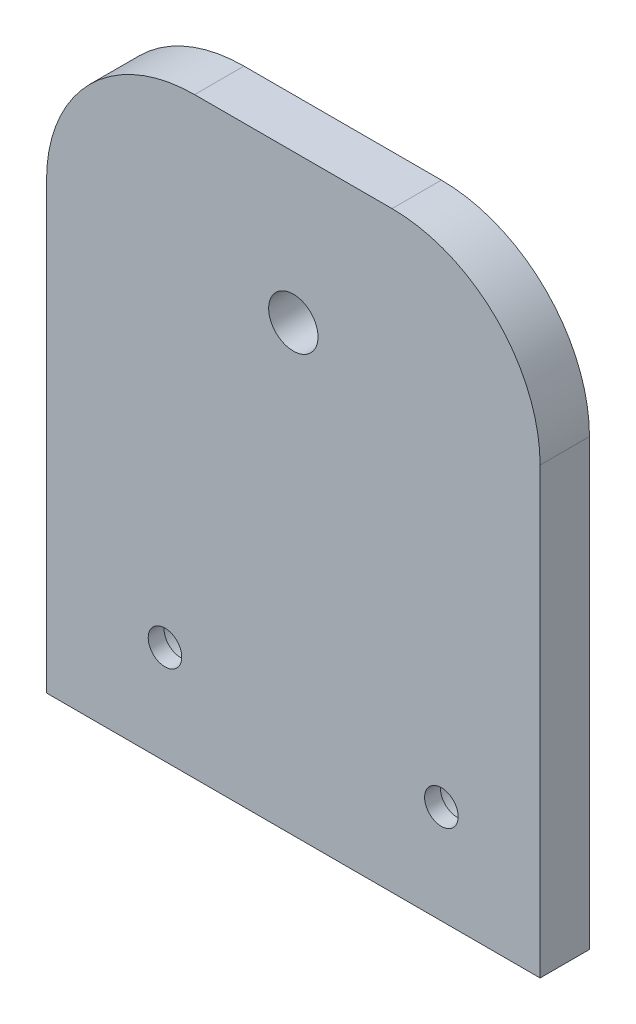
ISO-10303-21;
HEADER;
FILE_DESCRIPTION(('STEP AP214'),'2;1');
FILE_NAME('part.step','',(''),(''),'','','');
FILE_SCHEMA(('AUTOMOTIVE_DESIGN { 1 0 10303 214 1 1 1 1 }'));
ENDSEC;
DATA;
#1=APPLICATION_CONTEXT('core data for automotive mechanical design processes');
#2=APPLICATION_PROTOCOL_DEFINITION('international standard','automotive_design',2000,#1);
#3=PRODUCT_CONTEXT('',#1,'mechanical');
#4=PRODUCT('Part','Part','',(#3));
#5=PRODUCT_RELATED_PRODUCT_CATEGORY('part','',(#4));
#6=PRODUCT_DEFINITION_FORMATION('','',#4);
#7=PRODUCT_DEFINITION_CONTEXT('part definition',#1,'design');
#8=PRODUCT_DEFINITION('design','',#6,#7);
#9=PRODUCT_DEFINITION_SHAPE('','',#8);
#10=(LENGTH_UNIT() NAMED_UNIT(*) SI_UNIT(.MILLI.,.METRE.));
#11=(NAMED_UNIT(*) PLANE_ANGLE_UNIT() SI_UNIT($,.RADIAN.));
#12=(NAMED_UNIT(*) SI_UNIT($,.STERADIAN.) SOLID_ANGLE_UNIT());
#13=UNCERTAINTY_MEASURE_WITH_UNIT(LENGTH_MEASURE(1.E-05),#10,'distance_accuracy_value','');
#14=(GEOMETRIC_REPRESENTATION_CONTEXT(3) GLOBAL_UNCERTAINTY_ASSIGNED_CONTEXT((#13)) GLOBAL_UNIT_ASSIGNED_CONTEXT((#10,
#11,#12)) REPRESENTATION_CONTEXT('',''));
#15=CARTESIAN_POINT('',(0.,0.,0.));
#16=DIRECTION('',(0.,0.,1.));
#17=DIRECTION('',(1.,0.,0.));
#18=AXIS2_PLACEMENT_3D('',#15,#16,#17);
#19=CARTESIAN_POINT('',(15.,45.,5.));
#20=DIRECTION('',(0.,0.,-1.));
#21=DIRECTION('',(-1.,0.,0.));
#22=AXIS2_PLACEMENT_3D('',#19,#20,#21);
#23=PLANE('',#22);
#24=CARTESIAN_POINT('',(40.,10.,5.));
#25=DIRECTION('',(0.,0.,-1.));
#26=DIRECTION('',(-1.,0.,0.));
#27=AXIS2_PLACEMENT_3D('',#24,#25,#26);
#28=CIRCLE('',#27,1.7);
#29=CARTESIAN_POINT('',(38.3,10.,5.));
#30=VERTEX_POINT('',#29);
#31=EDGE_CURVE('E230',#30,#30,#28,.T.);
#32=ORIENTED_EDGE('',*,*,#31,.T.);
#33=EDGE_LOOP('',(#32));
#34=FACE_BOUND('',#33,.T.);
#35=CARTESIAN_POINT('',(12.,10.,5.));
#36=DIRECTION('',(0.,0.,-1.));
#37=DIRECTION('',(-1.,0.,0.));
#38=AXIS2_PLACEMENT_3D('',#35,#36,#37);
#39=CIRCLE('',#38,1.7);
#40=CARTESIAN_POINT('',(10.3,10.,5.));
#41=VERTEX_POINT('',#40);
#42=EDGE_CURVE('E245',#41,#41,#39,.T.);
#43=ORIENTED_EDGE('',*,*,#42,.T.);
#44=EDGE_LOOP('',(#43));
#45=FACE_BOUND('',#44,.T.);
#46=DIRECTION('',(0.,-1.,0.));
#47=VECTOR('',#46,1.);
#48=CARTESIAN_POINT('',(0.,0.,5.));
#49=LINE('',#48,#47);
#50=CARTESIAN_POINT('',(0.,44.9999999999999,5.));
#51=VERTEX_POINT('',#50);
#52=CARTESIAN_POINT('',(0.,0.,5.));
#53=VERTEX_POINT('',#52);
#54=EDGE_CURVE('E149',#51,#53,#49,.T.);
#55=ORIENTED_EDGE('',*,*,#54,.T.);
#56=DIRECTION('',(1.,0.,0.));
#57=VECTOR('',#56,1.);
#58=CARTESIAN_POINT('',(0.,0.,5.));
#59=LINE('',#58,#57);
#60=CARTESIAN_POINT('',(50.,0.,5.));
#61=VERTEX_POINT('',#60);
#62=EDGE_CURVE('E97',#53,#61,#59,.T.);
#63=ORIENTED_EDGE('',*,*,#62,.T.);
#64=DIRECTION('',(0.,1.,0.));
#65=VECTOR('',#64,1.);
#66=CARTESIAN_POINT('',(50.,0.,5.));
#67=LINE('',#66,#65);
#68=CARTESIAN_POINT('',(50.,44.9999999999999,5.));
#69=VERTEX_POINT('',#68);
#70=EDGE_CURVE('E110',#61,#69,#67,.T.);
#71=ORIENTED_EDGE('',*,*,#70,.T.);
#72=CARTESIAN_POINT('',(35.,45.,5.));
#73=DIRECTION('',(0.,0.,1.));
#74=DIRECTION('',(-1.,0.,0.));
#75=AXIS2_PLACEMENT_3D('',#72,#73,#74);
#76=CIRCLE('',#75,15.);
#77=CARTESIAN_POINT('',(34.9999999999999,60.,5.));
#78=VERTEX_POINT('',#77);
#79=EDGE_CURVE('E104',#69,#78,#76,.T.);
#80=ORIENTED_EDGE('',*,*,#79,.T.);
#81=DIRECTION('',(-1.,0.,0.));
#82=VECTOR('',#81,1.);
#83=CARTESIAN_POINT('',(15.0000000000001,60.,5.));
#84=LINE('',#83,#82);
#85=CARTESIAN_POINT('',(15.0000000000001,60.,5.));
#86=VERTEX_POINT('',#85);
#87=EDGE_CURVE('E108',#78,#86,#84,.T.);
#88=ORIENTED_EDGE('',*,*,#87,.T.);
#89=CARTESIAN_POINT('',(15.,45.,5.));
#90=DIRECTION('',(0.,0.,1.));
#91=DIRECTION('',(-1.,0.,0.));
#92=AXIS2_PLACEMENT_3D('',#89,#90,#91);
#93=CIRCLE('',#92,15.);
#94=EDGE_CURVE('E60',#86,#51,#93,.T.);
#95=ORIENTED_EDGE('',*,*,#94,.T.);
#96=EDGE_LOOP('',(#55,#63,#71,#80,#88,#95));
#97=FACE_BOUND('',#96,.T.);
#98=CARTESIAN_POINT('',(25.,45.,5.));
#99=DIRECTION('',(0.,0.,1.));
#100=DIRECTION('',(1.,0.,0.));
#101=AXIS2_PLACEMENT_3D('',#98,#99,#100);
#102=CIRCLE('',#101,2.5);
#103=CARTESIAN_POINT('',(27.5,45.,5.));
#104=VERTEX_POINT('',#103);
#105=EDGE_CURVE('E137',#104,#104,#102,.T.);
#106=ORIENTED_EDGE('',*,*,#105,.F.);
#107=EDGE_LOOP('',(#106));
#108=FACE_BOUND('',#107,.T.);
#109=ADVANCED_FACE('F42',(#34,#45,#97,#108),#23,.F.);
#110=CARTESIAN_POINT('',(15.,45.,0.));
#111=DIRECTION('',(0.,0.,-1.));
#112=DIRECTION('',(-1.,0.,0.));
#113=AXIS2_PLACEMENT_3D('',#110,#111,#112);
#114=PLANE('',#113);
#115=CARTESIAN_POINT('',(40.,10.,0.));
#116=DIRECTION('',(0.,0.,-1.));
#117=DIRECTION('',(-1.,0.,0.));
#118=AXIS2_PLACEMENT_3D('',#115,#116,#117);
#119=CIRCLE('',#118,3.25);
#120=CARTESIAN_POINT('',(36.75,10.,0.));
#121=VERTEX_POINT('',#120);
#122=EDGE_CURVE('E220',#121,#121,#119,.T.);
#123=ORIENTED_EDGE('',*,*,#122,.F.);
#124=EDGE_LOOP('',(#123));
#125=FACE_BOUND('',#124,.T.);
#126=CARTESIAN_POINT('',(12.,10.,0.));
#127=DIRECTION('',(0.,0.,-1.));
#128=DIRECTION('',(-1.,0.,0.));
#129=AXIS2_PLACEMENT_3D('',#126,#127,#128);
#130=CIRCLE('',#129,3.25);
#131=CARTESIAN_POINT('',(8.75,10.,0.));
#132=VERTEX_POINT('',#131);
#133=EDGE_CURVE('E233',#132,#132,#130,.T.);
#134=ORIENTED_EDGE('',*,*,#133,.F.);
#135=EDGE_LOOP('',(#134));
#136=FACE_BOUND('',#135,.T.);
#137=DIRECTION('',(0.,-1.,0.));
#138=VECTOR('',#137,1.);
#139=CARTESIAN_POINT('',(0.,0.,0.));
#140=LINE('',#139,#138);
#141=CARTESIAN_POINT('',(0.,44.9999999999999,0.));
#142=VERTEX_POINT('',#141);
#143=CARTESIAN_POINT('',(0.,0.,0.));
#144=VERTEX_POINT('',#143);
#145=EDGE_CURVE('E132',#142,#144,#140,.T.);
#146=ORIENTED_EDGE('',*,*,#145,.F.);
#147=CARTESIAN_POINT('',(15.,45.,0.));
#148=DIRECTION('',(0.,0.,1.));
#149=DIRECTION('',(-1.,0.,0.));
#150=AXIS2_PLACEMENT_3D('',#147,#148,#149);
#151=CIRCLE('',#150,15.);
#152=CARTESIAN_POINT('',(15.0000000000001,60.,0.));
#153=VERTEX_POINT('',#152);
#154=EDGE_CURVE('E89',#153,#142,#151,.T.);
#155=ORIENTED_EDGE('',*,*,#154,.F.);
#156=DIRECTION('',(-1.,0.,0.));
#157=VECTOR('',#156,1.);
#158=CARTESIAN_POINT('',(15.0000000000001,60.,0.));
#159=LINE('',#158,#157);
#160=CARTESIAN_POINT('',(34.9999999999999,60.,0.));
#161=VERTEX_POINT('',#160);
#162=EDGE_CURVE('E83',#161,#153,#159,.T.);
#163=ORIENTED_EDGE('',*,*,#162,.F.);
#164=CARTESIAN_POINT('',(35.,45.,0.));
#165=DIRECTION('',(0.,0.,1.));
#166=DIRECTION('',(-1.,0.,0.));
#167=AXIS2_PLACEMENT_3D('',#164,#165,#166);
#168=CIRCLE('',#167,15.);
#169=CARTESIAN_POINT('',(50.,44.9999999999999,0.));
#170=VERTEX_POINT('',#169);
#171=EDGE_CURVE('E119',#170,#161,#168,.T.);
#172=ORIENTED_EDGE('',*,*,#171,.F.);
#173=DIRECTION('',(0.,1.,0.));
#174=VECTOR('',#173,1.);
#175=CARTESIAN_POINT('',(50.,0.,0.));
#176=LINE('',#175,#174);
#177=CARTESIAN_POINT('',(50.,0.,0.));
#178=VERTEX_POINT('',#177);
#179=EDGE_CURVE('E140',#178,#170,#176,.T.);
#180=ORIENTED_EDGE('',*,*,#179,.F.);
#181=DIRECTION('',(1.,0.,0.));
#182=VECTOR('',#181,1.);
#183=CARTESIAN_POINT('',(0.,0.,0.));
#184=LINE('',#183,#182);
#185=EDGE_CURVE('E136',#144,#178,#184,.T.);
#186=ORIENTED_EDGE('',*,*,#185,.F.);
#187=EDGE_LOOP('',(#146,#155,#163,#172,#180,#186));
#188=FACE_BOUND('',#187,.T.);
#189=CARTESIAN_POINT('',(25.,45.,0.));
#190=DIRECTION('',(0.,0.,1.));
#191=DIRECTION('',(1.,0.,0.));
#192=AXIS2_PLACEMENT_3D('',#189,#190,#191);
#193=CIRCLE('',#192,2.5);
#194=CARTESIAN_POINT('',(27.5,45.,0.));
#195=VERTEX_POINT('',#194);
#196=EDGE_CURVE('E249',#195,#195,#193,.T.);
#197=ORIENTED_EDGE('',*,*,#196,.T.);
#198=EDGE_LOOP('',(#197));
#199=FACE_BOUND('',#198,.T.);
#200=ADVANCED_FACE('F162',(#125,#136,#188,#199),#114,.T.);
#201=CARTESIAN_POINT('',(0.,0.,5.));
#202=DIRECTION('',(1.,0.,0.));
#203=DIRECTION('',(0.,0.,-1.));
#204=AXIS2_PLACEMENT_3D('',#201,#202,#203);
#205=PLANE('',#204);
#206=ORIENTED_EDGE('',*,*,#145,.T.);
#207=DIRECTION('',(0.,0.,-1.));
#208=VECTOR('',#207,1.);
#209=CARTESIAN_POINT('',(0.,0.,5.));
#210=LINE('',#209,#208);
#211=EDGE_CURVE('E11',#53,#144,#210,.T.);
#212=ORIENTED_EDGE('',*,*,#211,.F.);
#213=ORIENTED_EDGE('',*,*,#54,.F.);
#214=DIRECTION('',(0.,0.,-1.));
#215=VECTOR('',#214,1.);
#216=CARTESIAN_POINT('',(0.,44.9999999999999,5.));
#217=LINE('',#216,#215);
#218=EDGE_CURVE('E128',#51,#142,#217,.T.);
#219=ORIENTED_EDGE('',*,*,#218,.T.);
#220=EDGE_LOOP('',(#206,#212,#213,#219));
#221=FACE_BOUND('',#220,.T.);
#222=ADVANCED_FACE('F44',(#221),#205,.F.);
#223=CARTESIAN_POINT('',(0.,0.,5.));
#224=DIRECTION('',(0.,1.,0.));
#225=DIRECTION('',(0.,0.,1.));
#226=AXIS2_PLACEMENT_3D('',#223,#224,#225);
#227=PLANE('',#226);
#228=ORIENTED_EDGE('',*,*,#185,.T.);
#229=DIRECTION('',(0.,0.,-1.));
#230=VECTOR('',#229,1.);
#231=CARTESIAN_POINT('',(50.,0.,5.));
#232=LINE('',#231,#230);
#233=EDGE_CURVE('E52',#61,#178,#232,.T.);
#234=ORIENTED_EDGE('',*,*,#233,.F.);
#235=ORIENTED_EDGE('',*,*,#62,.F.);
#236=ORIENTED_EDGE('',*,*,#211,.T.);
#237=EDGE_LOOP('',(#228,#234,#235,#236));
#238=FACE_BOUND('',#237,.T.);
#239=ADVANCED_FACE('F324',(#238),#227,.F.);
#240=CARTESIAN_POINT('',(50.,0.,5.));
#241=DIRECTION('',(-1.,0.,0.));
#242=DIRECTION('',(0.,-1.,0.));
#243=AXIS2_PLACEMENT_3D('',#240,#241,#242);
#244=PLANE('',#243);
#245=ORIENTED_EDGE('',*,*,#179,.T.);
#246=DIRECTION('',(0.,0.,-1.));
#247=VECTOR('',#246,1.);
#248=CARTESIAN_POINT('',(50.,44.9999999999999,5.));
#249=LINE('',#248,#247);
#250=EDGE_CURVE('E121',#69,#170,#249,.T.);
#251=ORIENTED_EDGE('',*,*,#250,.F.);
#252=ORIENTED_EDGE('',*,*,#70,.F.);
#253=ORIENTED_EDGE('',*,*,#233,.T.);
#254=EDGE_LOOP('',(#245,#251,#252,#253));
#255=FACE_BOUND('',#254,.T.);
#256=ADVANCED_FACE('F159',(#255),#244,.F.);
#257=CARTESIAN_POINT('',(35.,45.,5.));
#258=DIRECTION('',(0.,0.,-1.));
#259=DIRECTION('',(-1.,0.,0.));
#260=AXIS2_PLACEMENT_3D('',#257,#258,#259);
#261=CYLINDRICAL_SURFACE('',#260,15.);
#262=ORIENTED_EDGE('',*,*,#171,.T.);
#263=DIRECTION('',(0.,0.,-1.));
#264=VECTOR('',#263,1.);
#265=CARTESIAN_POINT('',(34.9999999999999,60.,5.));
#266=LINE('',#265,#264);
#267=EDGE_CURVE('E116',#78,#161,#266,.T.);
#268=ORIENTED_EDGE('',*,*,#267,.F.);
#269=ORIENTED_EDGE('',*,*,#79,.F.);
#270=ORIENTED_EDGE('',*,*,#250,.T.);
#271=EDGE_LOOP('',(#262,#268,#269,#270));
#272=FACE_BOUND('',#271,.T.);
#273=ADVANCED_FACE('F117',(#272),#261,.T.);
#274=CARTESIAN_POINT('',(15.0000000000001,60.,5.));
#275=DIRECTION('',(0.,-1.,0.));
#276=DIRECTION('',(0.,0.,-1.));
#277=AXIS2_PLACEMENT_3D('',#274,#275,#276);
#278=PLANE('',#277);
#279=ORIENTED_EDGE('',*,*,#162,.T.);
#280=DIRECTION('',(0.,0.,-1.));
#281=VECTOR('',#280,1.);
#282=CARTESIAN_POINT('',(15.0000000000001,60.,5.));
#283=LINE('',#282,#281);
#284=EDGE_CURVE('E122',#86,#153,#283,.T.);
#285=ORIENTED_EDGE('',*,*,#284,.F.);
#286=ORIENTED_EDGE('',*,*,#87,.F.);
#287=ORIENTED_EDGE('',*,*,#267,.T.);
#288=EDGE_LOOP('',(#279,#285,#286,#287));
#289=FACE_BOUND('',#288,.T.);
#290=ADVANCED_FACE('F124',(#289),#278,.F.);
#291=CARTESIAN_POINT('',(15.,45.,5.));
#292=DIRECTION('',(0.,0.,-1.));
#293=DIRECTION('',(-1.,0.,0.));
#294=AXIS2_PLACEMENT_3D('',#291,#292,#293);
#295=CYLINDRICAL_SURFACE('',#294,15.);
#296=ORIENTED_EDGE('',*,*,#154,.T.);
#297=ORIENTED_EDGE('',*,*,#218,.F.);
#298=ORIENTED_EDGE('',*,*,#94,.F.);
#299=ORIENTED_EDGE('',*,*,#284,.T.);
#300=EDGE_LOOP('',(#296,#297,#298,#299));
#301=FACE_BOUND('',#300,.T.);
#302=ADVANCED_FACE('F167',(#301),#295,.T.);
#303=CARTESIAN_POINT('',(25.,45.,5.));
#304=DIRECTION('',(0.,0.,-1.));
#305=DIRECTION('',(-1.,0.,0.));
#306=AXIS2_PLACEMENT_3D('',#303,#304,#305);
#307=CYLINDRICAL_SURFACE('',#306,2.5);
#308=ORIENTED_EDGE('',*,*,#105,.T.);
#309=EDGE_LOOP('',(#308));
#310=FACE_BOUND('',#309,.T.);
#311=ORIENTED_EDGE('',*,*,#196,.F.);
#312=EDGE_LOOP('',(#311));
#313=FACE_BOUND('',#312,.T.);
#314=ADVANCED_FACE('F169',(#310,#313),#307,.F.);
#315=CARTESIAN_POINT('',(12.,10.,0.));
#316=DIRECTION('',(0.,0.,-1.));
#317=DIRECTION('',(-1.,0.,0.));
#318=AXIS2_PLACEMENT_3D('',#315,#316,#317);
#319=CYLINDRICAL_SURFACE('',#318,1.7);
#320=ORIENTED_EDGE('',*,*,#42,.F.);
#321=EDGE_LOOP('',(#320));
#322=FACE_BOUND('',#321,.T.);
#323=CARTESIAN_POINT('',(12.,10.,3.4));
#324=DIRECTION('',(0.,0.,-1.));
#325=DIRECTION('',(-1.,0.,0.));
#326=AXIS2_PLACEMENT_3D('',#323,#324,#325);
#327=CIRCLE('',#326,1.7);
#328=CARTESIAN_POINT('',(10.3,10.,3.4));
#329=VERTEX_POINT('',#328);
#330=EDGE_CURVE('E241',#329,#329,#327,.T.);
#331=ORIENTED_EDGE('',*,*,#330,.T.);
#332=EDGE_LOOP('',(#331));
#333=FACE_BOUND('',#332,.T.);
#334=ADVANCED_FACE('F175',(#322,#333),#319,.F.);
#335=CARTESIAN_POINT('',(13.7,10.,3.4));
#336=DIRECTION('',(0.,0.,1.));
#337=DIRECTION('',(1.,0.,0.));
#338=AXIS2_PLACEMENT_3D('',#335,#336,#337);
#339=PLANE('',#338);
#340=ORIENTED_EDGE('',*,*,#330,.F.);
#341=EDGE_LOOP('',(#340));
#342=FACE_BOUND('',#341,.T.);
#343=CARTESIAN_POINT('',(12.,10.,3.4));
#344=DIRECTION('',(0.,0.,-1.));
#345=DIRECTION('',(-1.,0.,0.));
#346=AXIS2_PLACEMENT_3D('',#343,#344,#345);
#347=CIRCLE('',#346,3.25);
#348=CARTESIAN_POINT('',(8.75,10.,3.4));
#349=VERTEX_POINT('',#348);
#350=EDGE_CURVE('E237',#349,#349,#347,.T.);
#351=ORIENTED_EDGE('',*,*,#350,.T.);
#352=EDGE_LOOP('',(#351));
#353=FACE_BOUND('',#352,.T.);
#354=ADVANCED_FACE('F192',(#342,#353),#339,.F.);
#355=CARTESIAN_POINT('',(12.,10.,0.));
#356=DIRECTION('',(0.,0.,-1.));
#357=DIRECTION('',(-1.,0.,0.));
#358=AXIS2_PLACEMENT_3D('',#355,#356,#357);
#359=CYLINDRICAL_SURFACE('',#358,3.25);
#360=ORIENTED_EDGE('',*,*,#350,.F.);
#361=EDGE_LOOP('',(#360));
#362=FACE_BOUND('',#361,.T.);
#363=ORIENTED_EDGE('',*,*,#133,.T.);
#364=EDGE_LOOP('',(#363));
#365=FACE_BOUND('',#364,.T.);
#366=ADVANCED_FACE('F196',(#362,#365),#359,.F.);
#367=CARTESIAN_POINT('',(40.,10.,0.));
#368=DIRECTION('',(0.,0.,-1.));
#369=DIRECTION('',(-1.,0.,0.));
#370=AXIS2_PLACEMENT_3D('',#367,#368,#369);
#371=CYLINDRICAL_SURFACE('',#370,1.7);
#372=ORIENTED_EDGE('',*,*,#31,.F.);
#373=EDGE_LOOP('',(#372));
#374=FACE_BOUND('',#373,.T.);
#375=CARTESIAN_POINT('',(40.,10.,3.4));
#376=DIRECTION('',(0.,0.,-1.));
#377=DIRECTION('',(-1.,0.,0.));
#378=AXIS2_PLACEMENT_3D('',#375,#376,#377);
#379=CIRCLE('',#378,1.7);
#380=CARTESIAN_POINT('',(38.3,10.,3.4));
#381=VERTEX_POINT('',#380);
#382=EDGE_CURVE('E224',#381,#381,#379,.T.);
#383=ORIENTED_EDGE('',*,*,#382,.T.);
#384=EDGE_LOOP('',(#383));
#385=FACE_BOUND('',#384,.T.);
#386=ADVANCED_FACE('F200',(#374,#385),#371,.F.);
#387=CARTESIAN_POINT('',(41.7,10.,3.4));
#388=DIRECTION('',(0.,0.,1.));
#389=DIRECTION('',(1.,0.,0.));
#390=AXIS2_PLACEMENT_3D('',#387,#388,#389);
#391=PLANE('',#390);
#392=ORIENTED_EDGE('',*,*,#382,.F.);
#393=EDGE_LOOP('',(#392));
#394=FACE_BOUND('',#393,.T.);
#395=CARTESIAN_POINT('',(40.,10.,3.4));
#396=DIRECTION('',(0.,0.,-1.));
#397=DIRECTION('',(-1.,0.,0.));
#398=AXIS2_PLACEMENT_3D('',#395,#396,#397);
#399=CIRCLE('',#398,3.25);
#400=CARTESIAN_POINT('',(36.75,10.,3.4));
#401=VERTEX_POINT('',#400);
#402=EDGE_CURVE('E217',#401,#401,#399,.T.);
#403=ORIENTED_EDGE('',*,*,#402,.T.);
#404=EDGE_LOOP('',(#403));
#405=FACE_BOUND('',#404,.T.);
#406=ADVANCED_FACE('F204',(#394,#405),#391,.F.);
#407=CARTESIAN_POINT('',(40.,10.,0.));
#408=DIRECTION('',(0.,0.,-1.));
#409=DIRECTION('',(-1.,0.,0.));
#410=AXIS2_PLACEMENT_3D('',#407,#408,#409);
#411=CYLINDRICAL_SURFACE('',#410,3.25);
#412=ORIENTED_EDGE('',*,*,#402,.F.);
#413=EDGE_LOOP('',(#412));
#414=FACE_BOUND('',#413,.T.);
#415=ORIENTED_EDGE('',*,*,#122,.T.);
#416=EDGE_LOOP('',(#415));
#417=FACE_BOUND('',#416,.T.);
#418=ADVANCED_FACE('F208',(#414,#417),#411,.F.);
#419=CLOSED_SHELL('',(#109,#200,#222,#239,#256,#273,#290,#302,#314,#334,#354,#366,#386,#406,#418));
#420=MANIFOLD_SOLID_BREP('B2',#419);
#421=ADVANCED_BREP_SHAPE_REPRESENTATION('',(#18,#420),#14);
#422=SHAPE_DEFINITION_REPRESENTATION(#9,#421);
ENDSEC;
END-ISO-10303-21;
